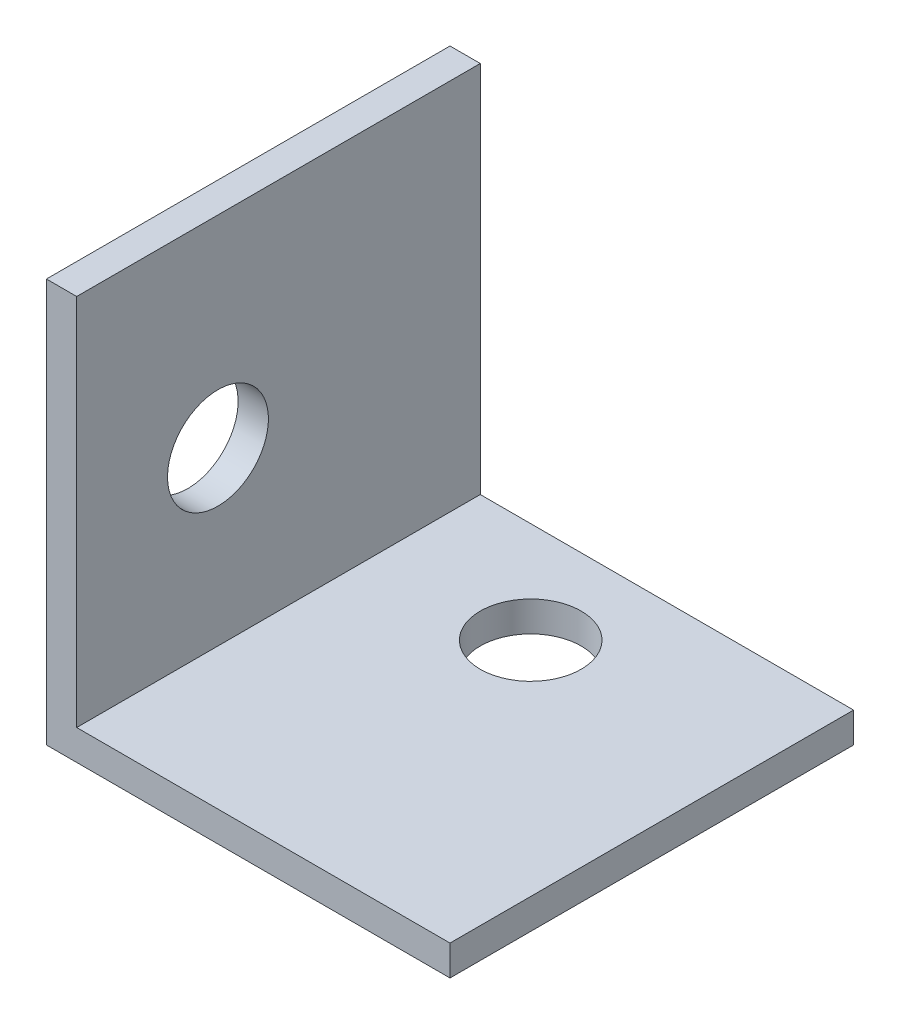
ISO-10303-21;
HEADER;
FILE_DESCRIPTION(('STEP AP214'),'2;1');
FILE_NAME('part.step','',(''),(''),'','','');
FILE_SCHEMA(('AUTOMOTIVE_DESIGN { 1 0 10303 214 1 1 1 1 }'));
ENDSEC;
DATA;
#1=APPLICATION_CONTEXT('core data for automotive mechanical design processes');
#2=APPLICATION_PROTOCOL_DEFINITION('international standard','automotive_design',2000,#1);
#3=PRODUCT_CONTEXT('',#1,'mechanical');
#4=PRODUCT('Part','Part','',(#3));
#5=PRODUCT_RELATED_PRODUCT_CATEGORY('part','',(#4));
#6=PRODUCT_DEFINITION_FORMATION('','',#4);
#7=PRODUCT_DEFINITION_CONTEXT('part definition',#1,'design');
#8=PRODUCT_DEFINITION('design','',#6,#7);
#9=PRODUCT_DEFINITION_SHAPE('','',#8);
#10=(LENGTH_UNIT() NAMED_UNIT(*) SI_UNIT(.MILLI.,.METRE.));
#11=(NAMED_UNIT(*) PLANE_ANGLE_UNIT() SI_UNIT($,.RADIAN.));
#12=(NAMED_UNIT(*) SI_UNIT($,.STERADIAN.) SOLID_ANGLE_UNIT());
#13=UNCERTAINTY_MEASURE_WITH_UNIT(LENGTH_MEASURE(1.E-05),#10,'distance_accuracy_value','');
#14=(GEOMETRIC_REPRESENTATION_CONTEXT(3) GLOBAL_UNCERTAINTY_ASSIGNED_CONTEXT((#13)) GLOBAL_UNIT_ASSIGNED_CONTEXT((#10,
#11,#12)) REPRESENTATION_CONTEXT('',''));
#15=CARTESIAN_POINT('',(0.,0.,0.));
#16=DIRECTION('',(0.,0.,1.));
#17=DIRECTION('',(1.,0.,0.));
#18=AXIS2_PLACEMENT_3D('',#15,#16,#17);
#19=CARTESIAN_POINT('',(1.5,0.,-20.));
#20=DIRECTION('',(-1.,0.,0.));
#21=DIRECTION('',(0.,0.,-1.));
#22=AXIS2_PLACEMENT_3D('',#19,#20,#21);
#23=PLANE('',#22);
#24=CARTESIAN_POINT('',(1.5,10.,-7.));
#25=DIRECTION('',(-1.,0.,0.));
#26=DIRECTION('',(0.,0.,1.));
#27=AXIS2_PLACEMENT_3D('',#24,#25,#26);
#28=CIRCLE('',#27,2.5);
#29=CARTESIAN_POINT('',(1.5,10.,-4.5));
#30=VERTEX_POINT('',#29);
#31=EDGE_CURVE('E151',#30,#30,#28,.T.);
#32=ORIENTED_EDGE('',*,*,#31,.T.);
#33=EDGE_LOOP('',(#32));
#34=FACE_BOUND('',#33,.T.);
#35=DIRECTION('',(0.,1.,0.));
#36=VECTOR('',#35,1.);
#37=CARTESIAN_POINT('',(1.5,0.,0.));
#38=LINE('',#37,#36);
#39=CARTESIAN_POINT('',(1.5,1.5,0.));
#40=VERTEX_POINT('',#39);
#41=CARTESIAN_POINT('',(1.5,20.,0.));
#42=VERTEX_POINT('',#41);
#43=EDGE_CURVE('E119',#40,#42,#38,.T.);
#44=ORIENTED_EDGE('',*,*,#43,.F.);
#45=DIRECTION('',(0.,0.,1.));
#46=VECTOR('',#45,1.);
#47=CARTESIAN_POINT('',(1.5,1.5,-20.));
#48=LINE('',#47,#46);
#49=CARTESIAN_POINT('',(1.5,1.5,-20.));
#50=VERTEX_POINT('',#49);
#51=EDGE_CURVE('E118',#50,#40,#48,.T.);
#52=ORIENTED_EDGE('',*,*,#51,.F.);
#53=DIRECTION('',(0.,1.,0.));
#54=VECTOR('',#53,1.);
#55=CARTESIAN_POINT('',(1.5,0.,-20.));
#56=LINE('',#55,#54);
#57=CARTESIAN_POINT('',(1.5,20.,-20.));
#58=VERTEX_POINT('',#57);
#59=EDGE_CURVE('E129',#50,#58,#56,.T.);
#60=ORIENTED_EDGE('',*,*,#59,.T.);
#61=DIRECTION('',(0.,0.,1.));
#62=VECTOR('',#61,1.);
#63=CARTESIAN_POINT('',(1.5,20.,-20.));
#64=LINE('',#63,#62);
#65=EDGE_CURVE('E11',#58,#42,#64,.T.);
#66=ORIENTED_EDGE('',*,*,#65,.T.);
#67=EDGE_LOOP('',(#44,#52,#60,#66));
#68=FACE_BOUND('',#67,.T.);
#69=ADVANCED_FACE('F35',(#34,#68),#23,.F.);
#70=CARTESIAN_POINT('',(0.,20.,-20.));
#71=DIRECTION('',(0.,1.,0.));
#72=DIRECTION('',(0.,0.,-1.));
#73=AXIS2_PLACEMENT_3D('',#70,#71,#72);
#74=PLANE('',#73);
#75=DIRECTION('',(1.,0.,0.));
#76=VECTOR('',#75,1.);
#77=CARTESIAN_POINT('',(0.,20.,0.));
#78=LINE('',#77,#76);
#79=CARTESIAN_POINT('',(0.,20.,0.));
#80=VERTEX_POINT('',#79);
#81=EDGE_CURVE('E121',#80,#42,#78,.T.);
#82=ORIENTED_EDGE('',*,*,#81,.T.);
#83=ORIENTED_EDGE('',*,*,#65,.F.);
#84=DIRECTION('',(1.,0.,0.));
#85=VECTOR('',#84,1.);
#86=CARTESIAN_POINT('',(0.,20.,-20.));
#87=LINE('',#86,#85);
#88=CARTESIAN_POINT('',(0.,20.,-20.));
#89=VERTEX_POINT('',#88);
#90=EDGE_CURVE('E84',#89,#58,#87,.T.);
#91=ORIENTED_EDGE('',*,*,#90,.F.);
#92=DIRECTION('',(0.,0.,1.));
#93=VECTOR('',#92,1.);
#94=CARTESIAN_POINT('',(0.,20.,-20.));
#95=LINE('',#94,#93);
#96=EDGE_CURVE('E44',#89,#80,#95,.T.);
#97=ORIENTED_EDGE('',*,*,#96,.T.);
#98=EDGE_LOOP('',(#82,#83,#91,#97));
#99=FACE_BOUND('',#98,.T.);
#100=ADVANCED_FACE('F137',(#99),#74,.T.);
#101=CARTESIAN_POINT('',(0.,0.,-20.));
#102=DIRECTION('',(-1.,0.,0.));
#103=DIRECTION('',(0.,0.,-1.));
#104=AXIS2_PLACEMENT_3D('',#101,#102,#103);
#105=PLANE('',#104);
#106=CARTESIAN_POINT('',(0.,10.,-7.));
#107=DIRECTION('',(-1.,0.,0.));
#108=DIRECTION('',(0.,0.,1.));
#109=AXIS2_PLACEMENT_3D('',#106,#107,#108);
#110=CIRCLE('',#109,2.5);
#111=CARTESIAN_POINT('',(0.,10.,-4.5));
#112=VERTEX_POINT('',#111);
#113=EDGE_CURVE('E150',#112,#112,#110,.T.);
#114=ORIENTED_EDGE('',*,*,#113,.F.);
#115=EDGE_LOOP('',(#114));
#116=FACE_BOUND('',#115,.T.);
#117=DIRECTION('',(0.,1.,0.));
#118=VECTOR('',#117,1.);
#119=CARTESIAN_POINT('',(0.,0.,0.));
#120=LINE('',#119,#118);
#121=CARTESIAN_POINT('',(0.,0.,0.));
#122=VERTEX_POINT('',#121);
#123=EDGE_CURVE('E123',#122,#80,#120,.T.);
#124=ORIENTED_EDGE('',*,*,#123,.T.);
#125=ORIENTED_EDGE('',*,*,#96,.F.);
#126=DIRECTION('',(0.,1.,0.));
#127=VECTOR('',#126,1.);
#128=CARTESIAN_POINT('',(0.,0.,-20.));
#129=LINE('',#128,#127);
#130=CARTESIAN_POINT('',(0.,0.,-20.));
#131=VERTEX_POINT('',#130);
#132=EDGE_CURVE('E112',#131,#89,#129,.T.);
#133=ORIENTED_EDGE('',*,*,#132,.F.);
#134=DIRECTION('',(0.,0.,1.));
#135=VECTOR('',#134,1.);
#136=CARTESIAN_POINT('',(0.,0.,-20.));
#137=LINE('',#136,#135);
#138=EDGE_CURVE('E106',#131,#122,#137,.T.);
#139=ORIENTED_EDGE('',*,*,#138,.T.);
#140=EDGE_LOOP('',(#124,#125,#133,#139));
#141=FACE_BOUND('',#140,.T.);
#142=ADVANCED_FACE('F160',(#116,#141),#105,.T.);
#143=CARTESIAN_POINT('',(0.,0.,-20.));
#144=DIRECTION('',(0.,-1.,0.));
#145=DIRECTION('',(0.,0.,1.));
#146=AXIS2_PLACEMENT_3D('',#143,#144,#145);
#147=PLANE('',#146);
#148=CARTESIAN_POINT('',(9.,0.,-15.));
#149=DIRECTION('',(0.,1.,0.));
#150=DIRECTION('',(0.,0.,1.));
#151=AXIS2_PLACEMENT_3D('',#148,#149,#150);
#152=CIRCLE('',#151,2.5);
#153=CARTESIAN_POINT('',(9.,0.,-12.5));
#154=VERTEX_POINT('',#153);
#155=EDGE_CURVE('E147',#154,#154,#152,.T.);
#156=ORIENTED_EDGE('',*,*,#155,.T.);
#157=EDGE_LOOP('',(#156));
#158=FACE_BOUND('',#157,.T.);
#159=DIRECTION('',(-1.,0.,0.));
#160=VECTOR('',#159,1.);
#161=CARTESIAN_POINT('',(0.,0.,0.));
#162=LINE('',#161,#160);
#163=CARTESIAN_POINT('',(20.,0.,0.));
#164=VERTEX_POINT('',#163);
#165=EDGE_CURVE('E125',#164,#122,#162,.T.);
#166=ORIENTED_EDGE('',*,*,#165,.T.);
#167=ORIENTED_EDGE('',*,*,#138,.F.);
#168=DIRECTION('',(-1.,0.,0.));
#169=VECTOR('',#168,1.);
#170=CARTESIAN_POINT('',(0.,0.,-20.));
#171=LINE('',#170,#169);
#172=CARTESIAN_POINT('',(20.,0.,-20.));
#173=VERTEX_POINT('',#172);
#174=EDGE_CURVE('E96',#173,#131,#171,.T.);
#175=ORIENTED_EDGE('',*,*,#174,.F.);
#176=DIRECTION('',(0.,0.,1.));
#177=VECTOR('',#176,1.);
#178=CARTESIAN_POINT('',(20.,0.,-20.));
#179=LINE('',#178,#177);
#180=EDGE_CURVE('E101',#173,#164,#179,.T.);
#181=ORIENTED_EDGE('',*,*,#180,.T.);
#182=EDGE_LOOP('',(#166,#167,#175,#181));
#183=FACE_BOUND('',#182,.T.);
#184=ADVANCED_FACE('F109',(#158,#183),#147,.T.);
#185=CARTESIAN_POINT('',(20.,1.5,-20.));
#186=DIRECTION('',(1.,0.,0.));
#187=DIRECTION('',(0.,0.,1.));
#188=AXIS2_PLACEMENT_3D('',#185,#186,#187);
#189=PLANE('',#188);
#190=DIRECTION('',(0.,-1.,0.));
#191=VECTOR('',#190,1.);
#192=CARTESIAN_POINT('',(20.,1.5,0.));
#193=LINE('',#192,#191);
#194=CARTESIAN_POINT('',(20.,1.5,0.));
#195=VERTEX_POINT('',#194);
#196=EDGE_CURVE('E103',#195,#164,#193,.T.);
#197=ORIENTED_EDGE('',*,*,#196,.T.);
#198=ORIENTED_EDGE('',*,*,#180,.F.);
#199=DIRECTION('',(0.,-1.,0.));
#200=VECTOR('',#199,1.);
#201=CARTESIAN_POINT('',(20.,1.5,-20.));
#202=LINE('',#201,#200);
#203=CARTESIAN_POINT('',(20.,1.5,-20.));
#204=VERTEX_POINT('',#203);
#205=EDGE_CURVE('E92',#204,#173,#202,.T.);
#206=ORIENTED_EDGE('',*,*,#205,.F.);
#207=DIRECTION('',(0.,0.,1.));
#208=VECTOR('',#207,1.);
#209=CARTESIAN_POINT('',(20.,1.5,-20.));
#210=LINE('',#209,#208);
#211=EDGE_CURVE('E107',#204,#195,#210,.T.);
#212=ORIENTED_EDGE('',*,*,#211,.T.);
#213=EDGE_LOOP('',(#197,#198,#206,#212));
#214=FACE_BOUND('',#213,.T.);
#215=ADVANCED_FACE('F102',(#214),#189,.T.);
#216=CARTESIAN_POINT('',(0.,1.5,-20.));
#217=DIRECTION('',(0.,-1.,0.));
#218=DIRECTION('',(0.,0.,1.));
#219=AXIS2_PLACEMENT_3D('',#216,#217,#218);
#220=PLANE('',#219);
#221=CARTESIAN_POINT('',(9.,1.5,-15.));
#222=DIRECTION('',(0.,1.,0.));
#223=DIRECTION('',(0.,0.,1.));
#224=AXIS2_PLACEMENT_3D('',#221,#222,#223);
#225=CIRCLE('',#224,2.5);
#226=CARTESIAN_POINT('',(9.,1.5,-12.5));
#227=VERTEX_POINT('',#226);
#228=EDGE_CURVE('E38',#227,#227,#225,.T.);
#229=ORIENTED_EDGE('',*,*,#228,.F.);
#230=EDGE_LOOP('',(#229));
#231=FACE_BOUND('',#230,.T.);
#232=DIRECTION('',(1.,0.,0.));
#233=VECTOR('',#232,1.);
#234=CARTESIAN_POINT('',(0.,1.5,0.));
#235=LINE('',#234,#233);
#236=EDGE_CURVE('E72',#195,#40,#235,.F.);
#237=ORIENTED_EDGE('',*,*,#236,.F.);
#238=ORIENTED_EDGE('',*,*,#211,.F.);
#239=DIRECTION('',(1.,0.,0.));
#240=VECTOR('',#239,1.);
#241=CARTESIAN_POINT('',(0.,1.5,-20.));
#242=LINE('',#241,#240);
#243=EDGE_CURVE('E52',#204,#50,#242,.F.);
#244=ORIENTED_EDGE('',*,*,#243,.T.);
#245=ORIENTED_EDGE('',*,*,#51,.T.);
#246=EDGE_LOOP('',(#237,#238,#244,#245));
#247=FACE_BOUND('',#246,.T.);
#248=ADVANCED_FACE('F185',(#231,#247),#220,.F.);
#249=CARTESIAN_POINT('',(0.,0.,-20.));
#250=DIRECTION('',(0.,0.,1.));
#251=DIRECTION('',(-1.,0.,0.));
#252=AXIS2_PLACEMENT_3D('',#249,#250,#251);
#253=PLANE('',#252);
#254=ORIENTED_EDGE('',*,*,#59,.F.);
#255=ORIENTED_EDGE('',*,*,#243,.F.);
#256=ORIENTED_EDGE('',*,*,#205,.T.);
#257=ORIENTED_EDGE('',*,*,#174,.T.);
#258=ORIENTED_EDGE('',*,*,#132,.T.);
#259=ORIENTED_EDGE('',*,*,#90,.T.);
#260=EDGE_LOOP('',(#254,#255,#256,#257,#258,#259));
#261=FACE_BOUND('',#260,.T.);
#262=ADVANCED_FACE('F94',(#261),#253,.F.);
#263=CARTESIAN_POINT('',(0.,0.,0.));
#264=DIRECTION('',(0.,0.,1.));
#265=DIRECTION('',(-1.,0.,0.));
#266=AXIS2_PLACEMENT_3D('',#263,#264,#265);
#267=PLANE('',#266);
#268=ORIENTED_EDGE('',*,*,#43,.T.);
#269=ORIENTED_EDGE('',*,*,#81,.F.);
#270=ORIENTED_EDGE('',*,*,#123,.F.);
#271=ORIENTED_EDGE('',*,*,#165,.F.);
#272=ORIENTED_EDGE('',*,*,#196,.F.);
#273=ORIENTED_EDGE('',*,*,#236,.T.);
#274=EDGE_LOOP('',(#268,#269,#270,#271,#272,#273));
#275=FACE_BOUND('',#274,.T.);
#276=ADVANCED_FACE('F140',(#275),#267,.T.);
#277=CARTESIAN_POINT('',(9.,20.,-15.));
#278=DIRECTION('',(0.,-1.,0.));
#279=DIRECTION('',(0.,0.,1.));
#280=AXIS2_PLACEMENT_3D('',#277,#278,#279);
#281=CYLINDRICAL_SURFACE('',#280,2.5);
#282=ORIENTED_EDGE('',*,*,#155,.F.);
#283=EDGE_LOOP('',(#282));
#284=FACE_BOUND('',#283,.T.);
#285=ORIENTED_EDGE('',*,*,#228,.T.);
#286=EDGE_LOOP('',(#285));
#287=FACE_BOUND('',#286,.T.);
#288=ADVANCED_FACE('F175',(#284,#287),#281,.F.);
#289=CARTESIAN_POINT('',(0.,10.,-7.));
#290=DIRECTION('',(1.,0.,0.));
#291=DIRECTION('',(0.,0.,1.));
#292=AXIS2_PLACEMENT_3D('',#289,#290,#291);
#293=CYLINDRICAL_SURFACE('',#292,2.5);
#294=ORIENTED_EDGE('',*,*,#113,.T.);
#295=EDGE_LOOP('',(#294));
#296=FACE_BOUND('',#295,.T.);
#297=ORIENTED_EDGE('',*,*,#31,.F.);
#298=EDGE_LOOP('',(#297));
#299=FACE_BOUND('',#298,.T.);
#300=ADVANCED_FACE('F157',(#296,#299),#293,.F.);
#301=CLOSED_SHELL('',(#69,#100,#142,#184,#215,#248,#262,#276,#288,#300));
#302=MANIFOLD_SOLID_BREP('B2',#301);
#303=ADVANCED_BREP_SHAPE_REPRESENTATION('',(#18,#302),#14);
#304=SHAPE_DEFINITION_REPRESENTATION(#9,#303);
ENDSEC;
END-ISO-10303-21;
